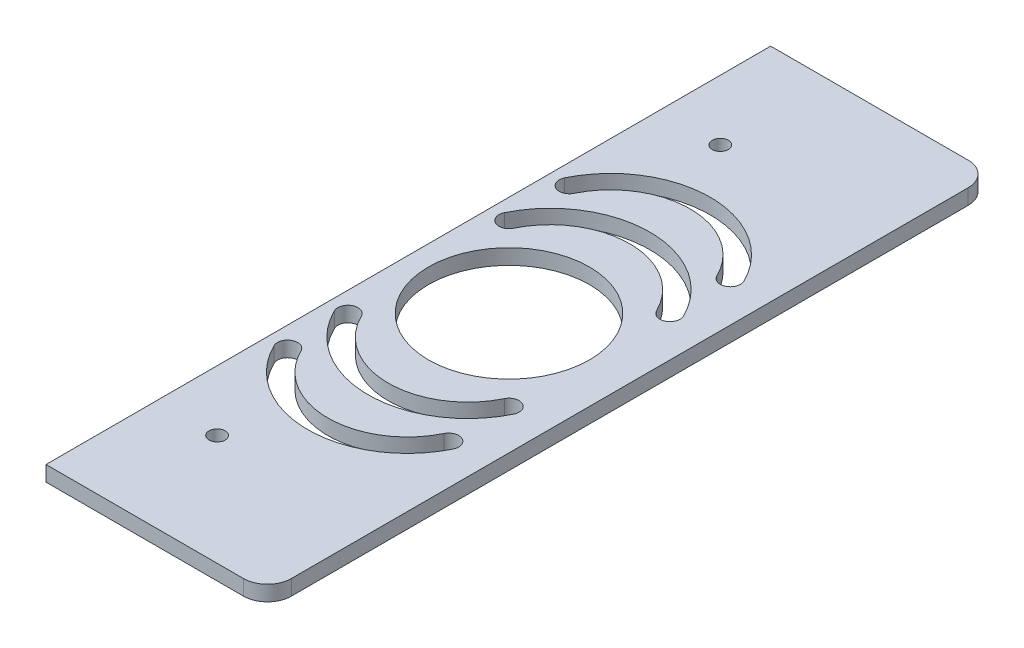
ISO-10303-21;
HEADER;
FILE_DESCRIPTION(('STEP AP214'),'2;1');
FILE_NAME('part.step','',(''),(''),'','','');
FILE_SCHEMA(('AUTOMOTIVE_DESIGN { 1 0 10303 214 1 1 1 1 }'));
ENDSEC;
DATA;
#1=APPLICATION_CONTEXT('core data for automotive mechanical design processes');
#2=APPLICATION_PROTOCOL_DEFINITION('international standard','automotive_design',2000,#1);
#3=PRODUCT_CONTEXT('',#1,'mechanical');
#4=PRODUCT('Part','Part','',(#3));
#5=PRODUCT_RELATED_PRODUCT_CATEGORY('part','',(#4));
#6=PRODUCT_DEFINITION_FORMATION('','',#4);
#7=PRODUCT_DEFINITION_CONTEXT('part definition',#1,'design');
#8=PRODUCT_DEFINITION('design','',#6,#7);
#9=PRODUCT_DEFINITION_SHAPE('','',#8);
#10=(LENGTH_UNIT() NAMED_UNIT(*) SI_UNIT(.MILLI.,.METRE.));
#11=(NAMED_UNIT(*) PLANE_ANGLE_UNIT() SI_UNIT($,.RADIAN.));
#12=(NAMED_UNIT(*) SI_UNIT($,.STERADIAN.) SOLID_ANGLE_UNIT());
#13=UNCERTAINTY_MEASURE_WITH_UNIT(LENGTH_MEASURE(1.E-05),#10,'distance_accuracy_value','');
#14=(GEOMETRIC_REPRESENTATION_CONTEXT(3) GLOBAL_UNCERTAINTY_ASSIGNED_CONTEXT((#13)) GLOBAL_UNIT_ASSIGNED_CONTEXT((#10,
#11,#12)) REPRESENTATION_CONTEXT('',''));
#15=CARTESIAN_POINT('',(0.,0.,0.));
#16=DIRECTION('',(0.,0.,1.));
#17=DIRECTION('',(1.,0.,0.));
#18=AXIS2_PLACEMENT_3D('',#15,#16,#17);
#19=CARTESIAN_POINT('',(0.,9.652,0.));
#20=DIRECTION('',(0.,-1.,0.));
#21=DIRECTION('',(0.,0.,-1.));
#22=AXIS2_PLACEMENT_3D('',#19,#20,#21);
#23=PLANE('',#22);
#24=CARTESIAN_POINT('',(12.7000000000004,9.65199999999999,-317.5));
#25=DIRECTION('',(0.,-1.,0.));
#26=DIRECTION('',(0.,0.,-1.));
#27=AXIS2_PLACEMENT_3D('',#24,#25,#26);
#28=CIRCLE('',#27,6.35000000000023);
#29=CARTESIAN_POINT('',(6.99213483146088,9.65199999999999,-320.282584269663));
#30=VERTEX_POINT('',#29);
#31=CARTESIAN_POINT('',(18.4078651685401,9.65199999999999,-314.717415730337));
#32=VERTEX_POINT('',#31);
#33=EDGE_CURVE('E222',#30,#32,#28,.F.);
#34=ORIENTED_EDGE('',*,*,#33,.F.);
#35=CARTESIAN_POINT('',(63.5000000000004,9.65199999999999,-292.735000000001));
#36=DIRECTION('',(0.,-1.,0.));
#37=DIRECTION('',(0.,0.,-1.));
#38=AXIS2_PLACEMENT_3D('',#35,#36,#37);
#39=CIRCLE('',#38,62.8649999999998);
#40=CARTESIAN_POINT('',(120.00786516854,9.65199999999999,-320.282584269663));
#41=VERTEX_POINT('',#40);
#42=EDGE_CURVE('E225',#41,#30,#39,.F.);
#43=ORIENTED_EDGE('',*,*,#42,.F.);
#44=CARTESIAN_POINT('',(114.3,9.65199999999999,-317.5));
#45=DIRECTION('',(0.,-1.,0.));
#46=DIRECTION('',(0.,0.,-1.));
#47=AXIS2_PLACEMENT_3D('',#44,#45,#46);
#48=CIRCLE('',#47,6.35000000000023);
#49=CARTESIAN_POINT('',(108.592134831461,9.65199999999999,-314.717415730337));
#50=VERTEX_POINT('',#49);
#51=EDGE_CURVE('E227',#50,#41,#48,.F.);
#52=ORIENTED_EDGE('',*,*,#51,.F.);
#53=CARTESIAN_POINT('',(63.5000000000004,9.65199999999999,-292.735000000001));
#54=DIRECTION('',(0.,-1.,0.));
#55=DIRECTION('',(0.,0.,-1.));
#56=AXIS2_PLACEMENT_3D('',#53,#54,#55);
#57=CIRCLE('',#56,50.1649999999993);
#58=EDGE_CURVE('E220',#32,#50,#57,.T.);
#59=ORIENTED_EDGE('',*,*,#58,.F.);
#60=EDGE_LOOP('',(#34,#43,#52,#59));
#61=FACE_BOUND('',#60,.T.);
#62=CARTESIAN_POINT('',(63.5000000000004,9.65199999999999,-164.464999999999));
#63=DIRECTION('',(0.,-1.,0.));
#64=DIRECTION('',(0.,0.,-1.));
#65=AXIS2_PLACEMENT_3D('',#62,#63,#64);
#66=CIRCLE('',#65,62.8649999999998);
#67=CARTESIAN_POINT('',(6.99213483146102,9.65199999999999,-136.917415730337));
#68=VERTEX_POINT('',#67);
#69=CARTESIAN_POINT('',(120.00786516854,9.65199999999999,-136.917415730337));
#70=VERTEX_POINT('',#69);
#71=EDGE_CURVE('E250',#68,#70,#66,.F.);
#72=ORIENTED_EDGE('',*,*,#71,.F.);
#73=CARTESIAN_POINT('',(12.7000000000004,9.65199999999999,-139.7));
#74=DIRECTION('',(0.,-1.,0.));
#75=DIRECTION('',(0.,0.,-1.));
#76=AXIS2_PLACEMENT_3D('',#73,#74,#75);
#77=CIRCLE('',#76,6.35000000000023);
#78=CARTESIAN_POINT('',(18.4078651685401,9.65199999999999,-142.482584269663));
#79=VERTEX_POINT('',#78);
#80=EDGE_CURVE('E253',#79,#68,#77,.F.);
#81=ORIENTED_EDGE('',*,*,#80,.F.);
#82=CARTESIAN_POINT('',(63.5000000000004,9.65199999999999,-164.464999999999));
#83=DIRECTION('',(0.,-1.,0.));
#84=DIRECTION('',(0.,0.,-1.));
#85=AXIS2_PLACEMENT_3D('',#82,#83,#84);
#86=CIRCLE('',#85,50.1649999999993);
#87=CARTESIAN_POINT('',(108.592134831461,9.65199999999999,-142.482584269663));
#88=VERTEX_POINT('',#87);
#89=EDGE_CURVE('E231',#88,#79,#86,.T.);
#90=ORIENTED_EDGE('',*,*,#89,.F.);
#91=CARTESIAN_POINT('',(114.3,9.65199999999999,-139.7));
#92=DIRECTION('',(0.,-1.,0.));
#93=DIRECTION('',(0.,0.,-1.));
#94=AXIS2_PLACEMENT_3D('',#91,#92,#93);
#95=CIRCLE('',#94,6.35000000000023);
#96=EDGE_CURVE('E248',#70,#88,#95,.F.);
#97=ORIENTED_EDGE('',*,*,#96,.F.);
#98=EDGE_LOOP('',(#72,#81,#90,#97));
#99=FACE_BOUND('',#98,.T.);
#100=CARTESIAN_POINT('',(63.5,9.65199999999999,-202.564999999999));
#101=DIRECTION('',(0.,-1.,0.));
#102=DIRECTION('',(0.,0.,-1.));
#103=AXIS2_PLACEMENT_3D('',#100,#101,#102);
#104=CIRCLE('',#103,62.8649999999997);
#105=CARTESIAN_POINT('',(6.99213483146063,9.65199999999999,-175.017415730337));
#106=VERTEX_POINT('',#105);
#107=CARTESIAN_POINT('',(120.00786516854,9.65199999999999,-175.017415730337));
#108=VERTEX_POINT('',#107);
#109=EDGE_CURVE('E649',#106,#108,#104,.F.);
#110=ORIENTED_EDGE('',*,*,#109,.F.);
#111=CARTESIAN_POINT('',(12.7,9.65199999999999,-177.8));
#112=DIRECTION('',(0.,-1.,0.));
#113=DIRECTION('',(0.,0.,-1.));
#114=AXIS2_PLACEMENT_3D('',#111,#112,#113);
#115=CIRCLE('',#114,6.35000000000023);
#116=CARTESIAN_POINT('',(18.4078651685397,9.65199999999999,-180.582584269663));
#117=VERTEX_POINT('',#116);
#118=EDGE_CURVE('E219',#117,#106,#115,.F.);
#119=ORIENTED_EDGE('',*,*,#118,.F.);
#120=CARTESIAN_POINT('',(63.5,9.65199999999999,-202.564999999999));
#121=DIRECTION('',(0.,-1.,0.));
#122=DIRECTION('',(0.,0.,-1.));
#123=AXIS2_PLACEMENT_3D('',#120,#121,#122);
#124=CIRCLE('',#123,50.1649999999993);
#125=CARTESIAN_POINT('',(108.59213483146,9.65199999999999,-180.582584269663));
#126=VERTEX_POINT('',#125);
#127=EDGE_CURVE('E216',#126,#117,#124,.T.);
#128=ORIENTED_EDGE('',*,*,#127,.F.);
#129=CARTESIAN_POINT('',(114.3,9.65199999999999,-177.8));
#130=DIRECTION('',(0.,-1.,0.));
#131=DIRECTION('',(0.,0.,-1.));
#132=AXIS2_PLACEMENT_3D('',#129,#130,#131);
#133=CIRCLE('',#132,6.35000000000023);
#134=EDGE_CURVE('E189',#108,#126,#133,.F.);
#135=ORIENTED_EDGE('',*,*,#134,.F.);
#136=EDGE_LOOP('',(#110,#119,#128,#135));
#137=FACE_BOUND('',#136,.T.);
#138=CARTESIAN_POINT('',(63.5,9.65199999999999,-254.635000000001));
#139=DIRECTION('',(0.,-1.,0.));
#140=DIRECTION('',(0.,0.,-1.));
#141=AXIS2_PLACEMENT_3D('',#138,#139,#140);
#142=CIRCLE('',#141,50.1649999999993);
#143=CARTESIAN_POINT('',(18.4078651685397,9.65199999999999,-276.617415730337));
#144=VERTEX_POINT('',#143);
#145=CARTESIAN_POINT('',(108.59213483146,9.65199999999999,-276.617415730337));
#146=VERTEX_POINT('',#145);
#147=EDGE_CURVE('E275',#144,#146,#142,.T.);
#148=ORIENTED_EDGE('',*,*,#147,.F.);
#149=CARTESIAN_POINT('',(12.7,9.65199999999999,-279.4));
#150=DIRECTION('',(0.,-1.,0.));
#151=DIRECTION('',(0.,0.,-1.));
#152=AXIS2_PLACEMENT_3D('',#149,#150,#151);
#153=CIRCLE('',#152,6.35000000000023);
#154=CARTESIAN_POINT('',(6.99213483146063,9.65199999999999,-282.182584269663));
#155=VERTEX_POINT('',#154);
#156=EDGE_CURVE('E278',#155,#144,#153,.F.);
#157=ORIENTED_EDGE('',*,*,#156,.F.);
#158=CARTESIAN_POINT('',(63.5,9.65199999999999,-254.635000000001));
#159=DIRECTION('',(0.,-1.,0.));
#160=DIRECTION('',(0.,0.,-1.));
#161=AXIS2_PLACEMENT_3D('',#158,#159,#160);
#162=CIRCLE('',#161,62.8649999999997);
#163=CARTESIAN_POINT('',(120.007865168539,9.65199999999999,-282.182584269663));
#164=VERTEX_POINT('',#163);
#165=EDGE_CURVE('E280',#164,#155,#162,.F.);
#166=ORIENTED_EDGE('',*,*,#165,.F.);
#167=CARTESIAN_POINT('',(114.3,9.65199999999999,-279.4));
#168=DIRECTION('',(0.,-1.,0.));
#169=DIRECTION('',(0.,0.,-1.));
#170=AXIS2_PLACEMENT_3D('',#167,#168,#169);
#171=CIRCLE('',#170,6.35000000000023);
#172=EDGE_CURVE('E272',#146,#164,#171,.F.);
#173=ORIENTED_EDGE('',*,*,#172,.F.);
#174=EDGE_LOOP('',(#148,#157,#166,#173));
#175=FACE_BOUND('',#174,.T.);
#176=DIRECTION('',(1.,0.,0.));
#177=VECTOR('',#176,1.);
#178=CARTESIAN_POINT('',(139.7,9.652,0.));
#179=LINE('',#178,#177);
#180=CARTESIAN_POINT('',(0.,9.652,0.));
#181=VERTEX_POINT('',#180);
#182=CARTESIAN_POINT('',(124.62,9.652,0.));
#183=VERTEX_POINT('',#182);
#184=EDGE_CURVE('E319',#181,#183,#179,.T.);
#185=ORIENTED_EDGE('',*,*,#184,.T.);
#186=CARTESIAN_POINT('',(124.62,9.652,-15.08));
#187=DIRECTION('',(0.,-1.,0.));
#188=DIRECTION('',(0.,0.,-1.));
#189=AXIS2_PLACEMENT_3D('',#186,#187,#188);
#190=CIRCLE('',#189,15.08);
#191=CARTESIAN_POINT('',(139.7,9.652,-15.08));
#192=VERTEX_POINT('',#191);
#193=EDGE_CURVE('E40',#183,#192,#190,.F.);
#194=ORIENTED_EDGE('',*,*,#193,.T.);
#195=DIRECTION('',(0.,0.,-1.));
#196=VECTOR('',#195,1.);
#197=CARTESIAN_POINT('',(139.7,9.652,-457.2));
#198=LINE('',#197,#196);
#199=CARTESIAN_POINT('',(139.7,9.652,-442.12));
#200=VERTEX_POINT('',#199);
#201=EDGE_CURVE('E322',#192,#200,#198,.T.);
#202=ORIENTED_EDGE('',*,*,#201,.T.);
#203=CARTESIAN_POINT('',(124.62,9.652,-442.12));
#204=DIRECTION('',(0.,-1.,0.));
#205=DIRECTION('',(0.,0.,-1.));
#206=AXIS2_PLACEMENT_3D('',#203,#204,#205);
#207=CIRCLE('',#206,15.08);
#208=CARTESIAN_POINT('',(124.62,9.652,-457.2));
#209=VERTEX_POINT('',#208);
#210=EDGE_CURVE('E355',#200,#209,#207,.F.);
#211=ORIENTED_EDGE('',*,*,#210,.T.);
#212=DIRECTION('',(-1.,0.,0.));
#213=VECTOR('',#212,1.);
#214=CARTESIAN_POINT('',(0.,9.652,-457.2));
#215=LINE('',#214,#213);
#216=CARTESIAN_POINT('',(0.,9.652,-457.2));
#217=VERTEX_POINT('',#216);
#218=EDGE_CURVE('E326',#209,#217,#215,.T.);
#219=ORIENTED_EDGE('',*,*,#218,.T.);
#220=DIRECTION('',(0.,0.,1.));
#221=VECTOR('',#220,1.);
#222=CARTESIAN_POINT('',(0.,9.652,0.));
#223=LINE('',#222,#221);
#224=EDGE_CURVE('E328',#217,#181,#223,.T.);
#225=ORIENTED_EDGE('',*,*,#224,.T.);
#226=EDGE_LOOP('',(#185,#194,#202,#211,#219,#225));
#227=FACE_BOUND('',#226,.T.);
#228=CARTESIAN_POINT('',(63.5,9.652,-228.6));
#229=DIRECTION('',(0.,1.,0.));
#230=DIRECTION('',(0.,0.,1.));
#231=AXIS2_PLACEMENT_3D('',#228,#229,#230);
#232=CIRCLE('',#231,50.8);
#233=CARTESIAN_POINT('',(63.5,9.652,-177.8));
#234=VERTEX_POINT('',#233);
#235=EDGE_CURVE('E313',#234,#234,#232,.T.);
#236=ORIENTED_EDGE('',*,*,#235,.F.);
#237=EDGE_LOOP('',(#236));
#238=FACE_BOUND('',#237,.T.);
#239=CARTESIAN_POINT('',(38.1,9.652,-69.85));
#240=DIRECTION('',(0.,1.,0.));
#241=DIRECTION('',(0.,0.,1.));
#242=AXIS2_PLACEMENT_3D('',#239,#240,#241);
#243=CIRCLE('',#242,5.08000000000001);
#244=CARTESIAN_POINT('',(38.1,9.652,-64.77));
#245=VERTEX_POINT('',#244);
#246=EDGE_CURVE('E307',#245,#245,#243,.T.);
#247=ORIENTED_EDGE('',*,*,#246,.F.);
#248=EDGE_LOOP('',(#247));
#249=FACE_BOUND('',#248,.T.);
#250=CARTESIAN_POINT('',(38.1,9.652,-387.35));
#251=DIRECTION('',(0.,1.,0.));
#252=DIRECTION('',(0.,0.,1.));
#253=AXIS2_PLACEMENT_3D('',#250,#251,#252);
#254=CIRCLE('',#253,5.08);
#255=CARTESIAN_POINT('',(38.1,9.652,-382.27));
#256=VERTEX_POINT('',#255);
#257=EDGE_CURVE('E301',#256,#256,#254,.T.);
#258=ORIENTED_EDGE('',*,*,#257,.F.);
#259=EDGE_LOOP('',(#258));
#260=FACE_BOUND('',#259,.T.);
#261=ADVANCED_FACE('F32',(#61,#99,#137,#175,#227,#238,#249,#260),#23,.F.);
#262=CARTESIAN_POINT('',(0.,0.,0.));
#263=DIRECTION('',(0.,-1.,0.));
#264=DIRECTION('',(0.,0.,-1.));
#265=AXIS2_PLACEMENT_3D('',#262,#263,#264);
#266=PLANE('',#265);
#267=CARTESIAN_POINT('',(63.5000000000004,0.,-292.735000000001));
#268=DIRECTION('',(0.,-1.,0.));
#269=DIRECTION('',(0.,0.,-1.));
#270=AXIS2_PLACEMENT_3D('',#267,#268,#269);
#271=CIRCLE('',#270,62.8649999999998);
#272=CARTESIAN_POINT('',(6.99213483146088,0.,-320.282584269663));
#273=VERTEX_POINT('',#272);
#274=CARTESIAN_POINT('',(120.00786516854,0.,-320.282584269663));
#275=VERTEX_POINT('',#274);
#276=EDGE_CURVE('E228',#273,#275,#271,.T.);
#277=ORIENTED_EDGE('',*,*,#276,.F.);
#278=CARTESIAN_POINT('',(12.7000000000004,0.,-317.5));
#279=DIRECTION('',(0.,-1.,0.));
#280=DIRECTION('',(0.,0.,-1.));
#281=AXIS2_PLACEMENT_3D('',#278,#279,#280);
#282=CIRCLE('',#281,6.35000000000023);
#283=CARTESIAN_POINT('',(18.40786516854,0.,-314.717415730337));
#284=VERTEX_POINT('',#283);
#285=EDGE_CURVE('E236',#284,#273,#282,.T.);
#286=ORIENTED_EDGE('',*,*,#285,.F.);
#287=CARTESIAN_POINT('',(63.5000000000004,0.,-292.735000000001));
#288=DIRECTION('',(0.,1.,0.));
#289=DIRECTION('',(0.,0.,-1.));
#290=AXIS2_PLACEMENT_3D('',#287,#288,#289);
#291=CIRCLE('',#290,50.1649999999993);
#292=CARTESIAN_POINT('',(108.592134831461,0.,-314.717415730337));
#293=VERTEX_POINT('',#292);
#294=EDGE_CURVE('E233',#293,#284,#291,.T.);
#295=ORIENTED_EDGE('',*,*,#294,.F.);
#296=CARTESIAN_POINT('',(114.3,0.,-317.5));
#297=DIRECTION('',(0.,-1.,0.));
#298=DIRECTION('',(0.,0.,-1.));
#299=AXIS2_PLACEMENT_3D('',#296,#297,#298);
#300=CIRCLE('',#299,6.35000000000023);
#301=EDGE_CURVE('E230',#275,#293,#300,.T.);
#302=ORIENTED_EDGE('',*,*,#301,.F.);
#303=EDGE_LOOP('',(#277,#286,#295,#302));
#304=FACE_BOUND('',#303,.T.);
#305=CARTESIAN_POINT('',(12.7000000000004,0.,-139.7));
#306=DIRECTION('',(0.,-1.,0.));
#307=DIRECTION('',(0.,0.,1.));
#308=AXIS2_PLACEMENT_3D('',#305,#306,#307);
#309=CIRCLE('',#308,6.35000000000023);
#310=CARTESIAN_POINT('',(6.99213483146102,0.,-136.917415730337));
#311=VERTEX_POINT('',#310);
#312=CARTESIAN_POINT('',(18.4078651685401,0.,-142.482584269663));
#313=VERTEX_POINT('',#312);
#314=EDGE_CURVE('E218',#311,#313,#309,.T.);
#315=ORIENTED_EDGE('',*,*,#314,.F.);
#316=CARTESIAN_POINT('',(63.5000000000004,0.,-164.464999999999));
#317=DIRECTION('',(0.,-1.,0.));
#318=DIRECTION('',(0.,0.,1.));
#319=AXIS2_PLACEMENT_3D('',#316,#317,#318);
#320=CIRCLE('',#319,62.8649999999998);
#321=CARTESIAN_POINT('',(120.00786516854,0.,-136.917415730337));
#322=VERTEX_POINT('',#321);
#323=EDGE_CURVE('E261',#322,#311,#320,.T.);
#324=ORIENTED_EDGE('',*,*,#323,.F.);
#325=CARTESIAN_POINT('',(114.3,0.,-139.7));
#326=DIRECTION('',(0.,-1.,0.));
#327=DIRECTION('',(0.,0.,1.));
#328=AXIS2_PLACEMENT_3D('',#325,#326,#327);
#329=CIRCLE('',#328,6.35000000000023);
#330=CARTESIAN_POINT('',(108.592134831461,0.,-142.482584269663));
#331=VERTEX_POINT('',#330);
#332=EDGE_CURVE('E258',#331,#322,#329,.T.);
#333=ORIENTED_EDGE('',*,*,#332,.F.);
#334=CARTESIAN_POINT('',(63.5000000000004,0.,-164.464999999999));
#335=DIRECTION('',(0.,1.,0.));
#336=DIRECTION('',(0.,0.,1.));
#337=AXIS2_PLACEMENT_3D('',#334,#335,#336);
#338=CIRCLE('',#337,50.1649999999993);
#339=EDGE_CURVE('E256',#313,#331,#338,.T.);
#340=ORIENTED_EDGE('',*,*,#339,.F.);
#341=EDGE_LOOP('',(#315,#324,#333,#340));
#342=FACE_BOUND('',#341,.T.);
#343=CARTESIAN_POINT('',(12.7,0.,-177.8));
#344=DIRECTION('',(0.,-1.,0.));
#345=DIRECTION('',(0.,0.,1.));
#346=AXIS2_PLACEMENT_3D('',#343,#344,#345);
#347=CIRCLE('',#346,6.35000000000023);
#348=CARTESIAN_POINT('',(6.99213483146063,0.,-175.017415730337));
#349=VERTEX_POINT('',#348);
#350=CARTESIAN_POINT('',(18.4078651685397,0.,-180.582584269663));
#351=VERTEX_POINT('',#350);
#352=EDGE_CURVE('E202',#349,#351,#347,.T.);
#353=ORIENTED_EDGE('',*,*,#352,.F.);
#354=CARTESIAN_POINT('',(63.5,0.,-202.564999999999));
#355=DIRECTION('',(0.,-1.,0.));
#356=DIRECTION('',(0.,0.,1.));
#357=AXIS2_PLACEMENT_3D('',#354,#355,#356);
#358=CIRCLE('',#357,62.8649999999997);
#359=CARTESIAN_POINT('',(120.007865168539,0.,-175.017415730337));
#360=VERTEX_POINT('',#359);
#361=EDGE_CURVE('E207',#360,#349,#358,.T.);
#362=ORIENTED_EDGE('',*,*,#361,.F.);
#363=CARTESIAN_POINT('',(114.3,0.,-177.8));
#364=DIRECTION('',(0.,-1.,0.));
#365=DIRECTION('',(0.,0.,1.));
#366=AXIS2_PLACEMENT_3D('',#363,#364,#365);
#367=CIRCLE('',#366,6.35000000000023);
#368=CARTESIAN_POINT('',(108.59213483146,0.,-180.582584269663));
#369=VERTEX_POINT('',#368);
#370=EDGE_CURVE('E186',#369,#360,#367,.T.);
#371=ORIENTED_EDGE('',*,*,#370,.F.);
#372=CARTESIAN_POINT('',(63.5,0.,-202.564999999999));
#373=DIRECTION('',(0.,1.,0.));
#374=DIRECTION('',(0.,0.,1.));
#375=AXIS2_PLACEMENT_3D('',#372,#373,#374);
#376=CIRCLE('',#375,50.1649999999993);
#377=EDGE_CURVE('E197',#351,#369,#376,.T.);
#378=ORIENTED_EDGE('',*,*,#377,.F.);
#379=EDGE_LOOP('',(#353,#362,#371,#378));
#380=FACE_BOUND('',#379,.T.);
#381=CARTESIAN_POINT('',(12.7,0.,-279.4));
#382=DIRECTION('',(0.,-1.,0.));
#383=DIRECTION('',(0.,0.,-1.));
#384=AXIS2_PLACEMENT_3D('',#381,#382,#383);
#385=CIRCLE('',#384,6.35000000000023);
#386=CARTESIAN_POINT('',(18.4078651685397,0.,-276.617415730337));
#387=VERTEX_POINT('',#386);
#388=CARTESIAN_POINT('',(6.99213483146063,0.,-282.182584269663));
#389=VERTEX_POINT('',#388);
#390=EDGE_CURVE('E247',#387,#389,#385,.T.);
#391=ORIENTED_EDGE('',*,*,#390,.F.);
#392=CARTESIAN_POINT('',(63.5,0.,-254.635000000001));
#393=DIRECTION('',(0.,1.,0.));
#394=DIRECTION('',(0.,0.,-1.));
#395=AXIS2_PLACEMENT_3D('',#392,#393,#394);
#396=CIRCLE('',#395,50.1649999999993);
#397=CARTESIAN_POINT('',(108.59213483146,0.,-276.617415730337));
#398=VERTEX_POINT('',#397);
#399=EDGE_CURVE('E288',#398,#387,#396,.T.);
#400=ORIENTED_EDGE('',*,*,#399,.F.);
#401=CARTESIAN_POINT('',(114.3,0.,-279.4));
#402=DIRECTION('',(0.,-1.,0.));
#403=DIRECTION('',(0.,0.,-1.));
#404=AXIS2_PLACEMENT_3D('',#401,#402,#403);
#405=CIRCLE('',#404,6.35000000000023);
#406=CARTESIAN_POINT('',(120.007865168539,0.,-282.182584269663));
#407=VERTEX_POINT('',#406);
#408=EDGE_CURVE('E285',#407,#398,#405,.T.);
#409=ORIENTED_EDGE('',*,*,#408,.F.);
#410=CARTESIAN_POINT('',(63.5,0.,-254.635000000001));
#411=DIRECTION('',(0.,-1.,0.));
#412=DIRECTION('',(0.,0.,-1.));
#413=AXIS2_PLACEMENT_3D('',#410,#411,#412);
#414=CIRCLE('',#413,62.8649999999997);
#415=EDGE_CURVE('E282',#389,#407,#414,.T.);
#416=ORIENTED_EDGE('',*,*,#415,.F.);
#417=EDGE_LOOP('',(#391,#400,#409,#416));
#418=FACE_BOUND('',#417,.T.);
#419=CARTESIAN_POINT('',(38.1,0.,-69.85));
#420=DIRECTION('',(0.,1.,0.));
#421=DIRECTION('',(0.,0.,1.));
#422=AXIS2_PLACEMENT_3D('',#419,#420,#421);
#423=CIRCLE('',#422,5.08000000000001);
#424=CARTESIAN_POINT('',(38.1,0.,-64.77));
#425=VERTEX_POINT('',#424);
#426=EDGE_CURVE('E304',#425,#425,#423,.T.);
#427=ORIENTED_EDGE('',*,*,#426,.T.);
#428=EDGE_LOOP('',(#427));
#429=FACE_BOUND('',#428,.T.);
#430=DIRECTION('',(0.,0.,-1.));
#431=VECTOR('',#430,1.);
#432=CARTESIAN_POINT('',(139.7,0.,-457.2));
#433=LINE('',#432,#431);
#434=CARTESIAN_POINT('',(139.7,0.,-15.08));
#435=VERTEX_POINT('',#434);
#436=CARTESIAN_POINT('',(139.7,0.,-442.12));
#437=VERTEX_POINT('',#436);
#438=EDGE_CURVE('E333',#435,#437,#433,.T.);
#439=ORIENTED_EDGE('',*,*,#438,.F.);
#440=CARTESIAN_POINT('',(124.62,0.,-15.08));
#441=DIRECTION('',(0.,-1.,0.));
#442=DIRECTION('',(0.,0.,-1.));
#443=AXIS2_PLACEMENT_3D('',#440,#441,#442);
#444=CIRCLE('',#443,15.08);
#445=CARTESIAN_POINT('',(124.62,0.,0.));
#446=VERTEX_POINT('',#445);
#447=EDGE_CURVE('E351',#435,#446,#444,.T.);
#448=ORIENTED_EDGE('',*,*,#447,.T.);
#449=DIRECTION('',(1.,0.,0.));
#450=VECTOR('',#449,1.);
#451=CARTESIAN_POINT('',(139.7,0.,0.));
#452=LINE('',#451,#450);
#453=CARTESIAN_POINT('',(0.,0.,0.));
#454=VERTEX_POINT('',#453);
#455=EDGE_CURVE('E316',#454,#446,#452,.T.);
#456=ORIENTED_EDGE('',*,*,#455,.F.);
#457=DIRECTION('',(0.,0.,1.));
#458=VECTOR('',#457,1.);
#459=CARTESIAN_POINT('',(0.,0.,0.));
#460=LINE('',#459,#458);
#461=CARTESIAN_POINT('',(0.,0.,-457.2));
#462=VERTEX_POINT('',#461);
#463=EDGE_CURVE('E323',#462,#454,#460,.T.);
#464=ORIENTED_EDGE('',*,*,#463,.F.);
#465=DIRECTION('',(-1.,0.,0.));
#466=VECTOR('',#465,1.);
#467=CARTESIAN_POINT('',(0.,0.,-457.2));
#468=LINE('',#467,#466);
#469=CARTESIAN_POINT('',(124.62,0.,-457.2));
#470=VERTEX_POINT('',#469);
#471=EDGE_CURVE('E336',#470,#462,#468,.T.);
#472=ORIENTED_EDGE('',*,*,#471,.F.);
#473=CARTESIAN_POINT('',(124.62,0.,-442.12));
#474=DIRECTION('',(0.,-1.,0.));
#475=DIRECTION('',(0.,0.,-1.));
#476=AXIS2_PLACEMENT_3D('',#473,#474,#475);
#477=CIRCLE('',#476,15.08);
#478=EDGE_CURVE('E349',#470,#437,#477,.T.);
#479=ORIENTED_EDGE('',*,*,#478,.T.);
#480=EDGE_LOOP('',(#439,#448,#456,#464,#472,#479));
#481=FACE_BOUND('',#480,.T.);
#482=CARTESIAN_POINT('',(63.5,0.,-228.6));
#483=DIRECTION('',(0.,1.,0.));
#484=DIRECTION('',(0.,0.,1.));
#485=AXIS2_PLACEMENT_3D('',#482,#483,#484);
#486=CIRCLE('',#485,50.8);
#487=CARTESIAN_POINT('',(63.5,0.,-177.8));
#488=VERTEX_POINT('',#487);
#489=EDGE_CURVE('E310',#488,#488,#486,.T.);
#490=ORIENTED_EDGE('',*,*,#489,.T.);
#491=EDGE_LOOP('',(#490));
#492=FACE_BOUND('',#491,.T.);
#493=CARTESIAN_POINT('',(38.1,0.,-387.35));
#494=DIRECTION('',(0.,1.,0.));
#495=DIRECTION('',(0.,0.,1.));
#496=AXIS2_PLACEMENT_3D('',#493,#494,#495);
#497=CIRCLE('',#496,5.08);
#498=CARTESIAN_POINT('',(38.1,0.,-382.27));
#499=VERTEX_POINT('',#498);
#500=EDGE_CURVE('E300',#499,#499,#497,.T.);
#501=ORIENTED_EDGE('',*,*,#500,.T.);
#502=EDGE_LOOP('',(#501));
#503=FACE_BOUND('',#502,.T.);
#504=ADVANCED_FACE('F204',(#304,#342,#380,#418,#429,#481,#492,#503),#266,.T.);
#505=CARTESIAN_POINT('',(139.7,9.652,0.));
#506=DIRECTION('',(0.,0.,-1.));
#507=DIRECTION('',(-1.,0.,0.));
#508=AXIS2_PLACEMENT_3D('',#505,#506,#507);
#509=PLANE('',#508);
#510=ORIENTED_EDGE('',*,*,#455,.T.);
#511=DIRECTION('',(0.,-1.,0.));
#512=VECTOR('',#511,1.);
#513=CARTESIAN_POINT('',(124.62,9.652,0.));
#514=LINE('',#513,#512);
#515=EDGE_CURVE('E353',#446,#183,#514,.F.);
#516=ORIENTED_EDGE('',*,*,#515,.T.);
#517=ORIENTED_EDGE('',*,*,#184,.F.);
#518=DIRECTION('',(0.,-1.,0.));
#519=VECTOR('',#518,1.);
#520=CARTESIAN_POINT('',(0.,9.652,0.));
#521=LINE('',#520,#519);
#522=EDGE_CURVE('E330',#181,#454,#521,.T.);
#523=ORIENTED_EDGE('',*,*,#522,.T.);
#524=EDGE_LOOP('',(#510,#516,#517,#523));
#525=FACE_BOUND('',#524,.T.);
#526=ADVANCED_FACE('F375',(#525),#509,.F.);
#527=CARTESIAN_POINT('',(139.7,9.652,-457.2));
#528=DIRECTION('',(-1.,0.,0.));
#529=DIRECTION('',(0.,0.,1.));
#530=AXIS2_PLACEMENT_3D('',#527,#528,#529);
#531=PLANE('',#530);
#532=ORIENTED_EDGE('',*,*,#201,.F.);
#533=DIRECTION('',(0.,-1.,0.));
#534=VECTOR('',#533,1.);
#535=CARTESIAN_POINT('',(139.7,9.652,-15.08));
#536=LINE('',#535,#534);
#537=EDGE_CURVE('E346',#192,#435,#536,.T.);
#538=ORIENTED_EDGE('',*,*,#537,.T.);
#539=ORIENTED_EDGE('',*,*,#438,.T.);
#540=DIRECTION('',(0.,-1.,0.));
#541=VECTOR('',#540,1.);
#542=CARTESIAN_POINT('',(139.7,9.652,-442.12));
#543=LINE('',#542,#541);
#544=EDGE_CURVE('E344',#437,#200,#543,.F.);
#545=ORIENTED_EDGE('',*,*,#544,.T.);
#546=EDGE_LOOP('',(#532,#538,#539,#545));
#547=FACE_BOUND('',#546,.T.);
#548=ADVANCED_FACE('F366',(#547),#531,.F.);
#549=CARTESIAN_POINT('',(0.,9.652,-457.2));
#550=DIRECTION('',(0.,0.,1.));
#551=DIRECTION('',(1.,0.,0.));
#552=AXIS2_PLACEMENT_3D('',#549,#550,#551);
#553=PLANE('',#552);
#554=ORIENTED_EDGE('',*,*,#218,.F.);
#555=DIRECTION('',(0.,-1.,0.));
#556=VECTOR('',#555,1.);
#557=CARTESIAN_POINT('',(124.62,9.652,-457.2));
#558=LINE('',#557,#556);
#559=EDGE_CURVE('E11',#209,#470,#558,.T.);
#560=ORIENTED_EDGE('',*,*,#559,.T.);
#561=ORIENTED_EDGE('',*,*,#471,.T.);
#562=DIRECTION('',(0.,-1.,0.));
#563=VECTOR('',#562,1.);
#564=CARTESIAN_POINT('',(0.,9.652,-457.2));
#565=LINE('',#564,#563);
#566=EDGE_CURVE('E341',#217,#462,#565,.T.);
#567=ORIENTED_EDGE('',*,*,#566,.F.);
#568=EDGE_LOOP('',(#554,#560,#561,#567));
#569=FACE_BOUND('',#568,.T.);
#570=ADVANCED_FACE('F384',(#569),#553,.F.);
#571=CARTESIAN_POINT('',(0.,9.652,0.));
#572=DIRECTION('',(1.,0.,0.));
#573=DIRECTION('',(0.,0.,-1.));
#574=AXIS2_PLACEMENT_3D('',#571,#572,#573);
#575=PLANE('',#574);
#576=ORIENTED_EDGE('',*,*,#463,.T.);
#577=ORIENTED_EDGE('',*,*,#522,.F.);
#578=ORIENTED_EDGE('',*,*,#224,.F.);
#579=ORIENTED_EDGE('',*,*,#566,.T.);
#580=EDGE_LOOP('',(#576,#577,#578,#579));
#581=FACE_BOUND('',#580,.T.);
#582=ADVANCED_FACE('F379',(#581),#575,.F.);
#583=CARTESIAN_POINT('',(63.5,9.652,-228.6));
#584=DIRECTION('',(0.,-1.,0.));
#585=DIRECTION('',(0.,0.,-1.));
#586=AXIS2_PLACEMENT_3D('',#583,#584,#585);
#587=CYLINDRICAL_SURFACE('',#586,50.8);
#588=ORIENTED_EDGE('',*,*,#235,.T.);
#589=EDGE_LOOP('',(#588));
#590=FACE_BOUND('',#589,.T.);
#591=ORIENTED_EDGE('',*,*,#489,.F.);
#592=EDGE_LOOP('',(#591));
#593=FACE_BOUND('',#592,.T.);
#594=ADVANCED_FACE('F408',(#590,#593),#587,.F.);
#595=CARTESIAN_POINT('',(38.1,9.652,-69.85));
#596=DIRECTION('',(0.,-1.,0.));
#597=DIRECTION('',(0.,0.,-1.));
#598=AXIS2_PLACEMENT_3D('',#595,#596,#597);
#599=CYLINDRICAL_SURFACE('',#598,5.08000000000001);
#600=ORIENTED_EDGE('',*,*,#246,.T.);
#601=EDGE_LOOP('',(#600));
#602=FACE_BOUND('',#601,.T.);
#603=ORIENTED_EDGE('',*,*,#426,.F.);
#604=EDGE_LOOP('',(#603));
#605=FACE_BOUND('',#604,.T.);
#606=ADVANCED_FACE('F442',(#602,#605),#599,.F.);
#607=CARTESIAN_POINT('',(38.1,9.652,-387.35));
#608=DIRECTION('',(0.,-1.,0.));
#609=DIRECTION('',(0.,0.,-1.));
#610=AXIS2_PLACEMENT_3D('',#607,#608,#609);
#611=CYLINDRICAL_SURFACE('',#610,5.08);
#612=ORIENTED_EDGE('',*,*,#257,.T.);
#613=EDGE_LOOP('',(#612));
#614=FACE_BOUND('',#613,.T.);
#615=ORIENTED_EDGE('',*,*,#500,.F.);
#616=EDGE_LOOP('',(#615));
#617=FACE_BOUND('',#616,.T.);
#618=ADVANCED_FACE('F396',(#614,#617),#611,.F.);
#619=CARTESIAN_POINT('',(124.62,9.652,-15.08));
#620=DIRECTION('',(0.,-1.,0.));
#621=DIRECTION('',(0.,0.,-1.));
#622=AXIS2_PLACEMENT_3D('',#619,#620,#621);
#623=CYLINDRICAL_SURFACE('',#622,15.08);
#624=ORIENTED_EDGE('',*,*,#193,.F.);
#625=ORIENTED_EDGE('',*,*,#515,.F.);
#626=ORIENTED_EDGE('',*,*,#447,.F.);
#627=ORIENTED_EDGE('',*,*,#537,.F.);
#628=EDGE_LOOP('',(#624,#625,#626,#627));
#629=FACE_BOUND('',#628,.T.);
#630=ADVANCED_FACE('F369',(#629),#623,.T.);
#631=CARTESIAN_POINT('',(124.62,9.652,-442.12));
#632=DIRECTION('',(0.,-1.,0.));
#633=DIRECTION('',(0.,0.,-1.));
#634=AXIS2_PLACEMENT_3D('',#631,#632,#633);
#635=CYLINDRICAL_SURFACE('',#634,15.08);
#636=ORIENTED_EDGE('',*,*,#210,.F.);
#637=ORIENTED_EDGE('',*,*,#544,.F.);
#638=ORIENTED_EDGE('',*,*,#478,.F.);
#639=ORIENTED_EDGE('',*,*,#559,.F.);
#640=EDGE_LOOP('',(#636,#637,#638,#639));
#641=FACE_BOUND('',#640,.T.);
#642=ADVANCED_FACE('F34',(#641),#635,.T.);
#643=CARTESIAN_POINT('',(12.7,132.290870265508,-279.4));
#644=DIRECTION('',(0.,-1.,0.));
#645=DIRECTION('',(0.,0.,-1.));
#646=AXIS2_PLACEMENT_3D('',#643,#644,#645);
#647=CYLINDRICAL_SURFACE('',#646,6.35000000000023);
#648=ORIENTED_EDGE('',*,*,#156,.T.);
#649=DIRECTION('',(0.,-1.,0.));
#650=VECTOR('',#649,1.);
#651=CARTESIAN_POINT('',(18.4078651685397,132.290870265508,-276.617415730337));
#652=LINE('',#651,#650);
#653=EDGE_CURVE('E276',#144,#387,#652,.T.);
#654=ORIENTED_EDGE('',*,*,#653,.T.);
#655=ORIENTED_EDGE('',*,*,#390,.T.);
#656=DIRECTION('',(0.,-1.,0.));
#657=VECTOR('',#656,1.);
#658=CARTESIAN_POINT('',(6.99213483146063,132.290870265508,-282.182584269663));
#659=LINE('',#658,#657);
#660=EDGE_CURVE('E291',#155,#389,#659,.T.);
#661=ORIENTED_EDGE('',*,*,#660,.F.);
#662=EDGE_LOOP('',(#648,#654,#655,#661));
#663=FACE_BOUND('',#662,.T.);
#664=ADVANCED_FACE('F388',(#663),#647,.F.);
#665=CARTESIAN_POINT('',(63.5,132.290870265508,-254.635000000001));
#666=DIRECTION('',(0.,-1.,0.));
#667=DIRECTION('',(0.,0.,-1.));
#668=AXIS2_PLACEMENT_3D('',#665,#666,#667);
#669=CYLINDRICAL_SURFACE('',#668,50.1649999999993);
#670=ORIENTED_EDGE('',*,*,#147,.T.);
#671=DIRECTION('',(0.,-1.,0.));
#672=VECTOR('',#671,1.);
#673=CARTESIAN_POINT('',(108.59213483146,132.290870265508,-276.617415730337));
#674=LINE('',#673,#672);
#675=EDGE_CURVE('E293',#146,#398,#674,.T.);
#676=ORIENTED_EDGE('',*,*,#675,.T.);
#677=ORIENTED_EDGE('',*,*,#399,.T.);
#678=ORIENTED_EDGE('',*,*,#653,.F.);
#679=EDGE_LOOP('',(#670,#676,#677,#678));
#680=FACE_BOUND('',#679,.T.);
#681=ADVANCED_FACE('F393',(#680),#669,.T.);
#682=CARTESIAN_POINT('',(114.3,132.290870265508,-279.4));
#683=DIRECTION('',(0.,-1.,0.));
#684=DIRECTION('',(0.,0.,-1.));
#685=AXIS2_PLACEMENT_3D('',#682,#683,#684);
#686=CYLINDRICAL_SURFACE('',#685,6.35000000000023);
#687=ORIENTED_EDGE('',*,*,#172,.T.);
#688=DIRECTION('',(0.,-1.,0.));
#689=VECTOR('',#688,1.);
#690=CARTESIAN_POINT('',(120.007865168539,132.290870265508,-282.182584269663));
#691=LINE('',#690,#689);
#692=EDGE_CURVE('E295',#164,#407,#691,.T.);
#693=ORIENTED_EDGE('',*,*,#692,.T.);
#694=ORIENTED_EDGE('',*,*,#408,.T.);
#695=ORIENTED_EDGE('',*,*,#675,.F.);
#696=EDGE_LOOP('',(#687,#693,#694,#695));
#697=FACE_BOUND('',#696,.T.);
#698=ADVANCED_FACE('F485',(#697),#686,.F.);
#699=CARTESIAN_POINT('',(63.5,132.290870265508,-254.635000000001));
#700=DIRECTION('',(0.,-1.,0.));
#701=DIRECTION('',(0.,0.,-1.));
#702=AXIS2_PLACEMENT_3D('',#699,#700,#701);
#703=CYLINDRICAL_SURFACE('',#702,62.8649999999997);
#704=ORIENTED_EDGE('',*,*,#165,.T.);
#705=ORIENTED_EDGE('',*,*,#660,.T.);
#706=ORIENTED_EDGE('',*,*,#415,.T.);
#707=ORIENTED_EDGE('',*,*,#692,.F.);
#708=EDGE_LOOP('',(#704,#705,#706,#707));
#709=FACE_BOUND('',#708,.T.);
#710=ADVANCED_FACE('F495',(#709),#703,.F.);
#711=CARTESIAN_POINT('',(12.7,132.290870265508,-177.8));
#712=DIRECTION('',(0.,-1.,0.));
#713=DIRECTION('',(0.,0.,-1.));
#714=AXIS2_PLACEMENT_3D('',#711,#712,#713);
#715=CYLINDRICAL_SURFACE('',#714,6.35000000000023);
#716=ORIENTED_EDGE('',*,*,#118,.T.);
#717=DIRECTION('',(0.,-1.,0.));
#718=VECTOR('',#717,1.);
#719=CARTESIAN_POINT('',(6.99213483146063,132.290870265508,-175.017415730337));
#720=LINE('',#719,#718);
#721=EDGE_CURVE('E212',#106,#349,#720,.T.);
#722=ORIENTED_EDGE('',*,*,#721,.T.);
#723=ORIENTED_EDGE('',*,*,#352,.T.);
#724=DIRECTION('',(0.,-1.,0.));
#725=VECTOR('',#724,1.);
#726=CARTESIAN_POINT('',(18.4078651685397,132.290870265508,-180.582584269663));
#727=LINE('',#726,#725);
#728=EDGE_CURVE('E193',#117,#351,#727,.T.);
#729=ORIENTED_EDGE('',*,*,#728,.F.);
#730=EDGE_LOOP('',(#716,#722,#723,#729));
#731=FACE_BOUND('',#730,.T.);
#732=ADVANCED_FACE('F505',(#731),#715,.F.);
#733=CARTESIAN_POINT('',(63.5,132.290870265508,-202.564999999999));
#734=DIRECTION('',(0.,-1.,0.));
#735=DIRECTION('',(0.,0.,-1.));
#736=AXIS2_PLACEMENT_3D('',#733,#734,#735);
#737=CYLINDRICAL_SURFACE('',#736,62.8649999999997);
#738=ORIENTED_EDGE('',*,*,#109,.T.);
#739=DIRECTION('',(0.,-1.,0.));
#740=VECTOR('',#739,1.);
#741=CARTESIAN_POINT('',(120.007865168539,132.290870265508,-175.017415730337));
#742=LINE('',#741,#740);
#743=EDGE_CURVE('E192',#108,#360,#742,.T.);
#744=ORIENTED_EDGE('',*,*,#743,.T.);
#745=ORIENTED_EDGE('',*,*,#361,.T.);
#746=ORIENTED_EDGE('',*,*,#721,.F.);
#747=EDGE_LOOP('',(#738,#744,#745,#746));
#748=FACE_BOUND('',#747,.T.);
#749=ADVANCED_FACE('F515',(#748),#737,.F.);
#750=CARTESIAN_POINT('',(114.3,132.290870265508,-177.8));
#751=DIRECTION('',(0.,-1.,0.));
#752=DIRECTION('',(0.,0.,-1.));
#753=AXIS2_PLACEMENT_3D('',#750,#751,#752);
#754=CYLINDRICAL_SURFACE('',#753,6.35000000000023);
#755=ORIENTED_EDGE('',*,*,#134,.T.);
#756=DIRECTION('',(0.,-1.,0.));
#757=VECTOR('',#756,1.);
#758=CARTESIAN_POINT('',(108.59213483146,132.290870265508,-180.582584269663));
#759=LINE('',#758,#757);
#760=EDGE_CURVE('E181',#126,#369,#759,.T.);
#761=ORIENTED_EDGE('',*,*,#760,.T.);
#762=ORIENTED_EDGE('',*,*,#370,.T.);
#763=ORIENTED_EDGE('',*,*,#743,.F.);
#764=EDGE_LOOP('',(#755,#761,#762,#763));
#765=FACE_BOUND('',#764,.T.);
#766=ADVANCED_FACE('F183',(#765),#754,.F.);
#767=CARTESIAN_POINT('',(63.5,132.290870265508,-202.564999999999));
#768=DIRECTION('',(0.,-1.,0.));
#769=DIRECTION('',(0.,0.,-1.));
#770=AXIS2_PLACEMENT_3D('',#767,#768,#769);
#771=CYLINDRICAL_SURFACE('',#770,50.1649999999993);
#772=ORIENTED_EDGE('',*,*,#127,.T.);
#773=ORIENTED_EDGE('',*,*,#728,.T.);
#774=ORIENTED_EDGE('',*,*,#377,.T.);
#775=ORIENTED_EDGE('',*,*,#760,.F.);
#776=EDGE_LOOP('',(#772,#773,#774,#775));
#777=FACE_BOUND('',#776,.T.);
#778=ADVANCED_FACE('F198',(#777),#771,.T.);
#779=CARTESIAN_POINT('',(12.7000000000004,132.290870265508,-139.7));
#780=DIRECTION('',(0.,-1.,0.));
#781=DIRECTION('',(0.,0.,-1.));
#782=AXIS2_PLACEMENT_3D('',#779,#780,#781);
#783=CYLINDRICAL_SURFACE('',#782,6.35000000000023);
#784=ORIENTED_EDGE('',*,*,#80,.T.);
#785=DIRECTION('',(0.,-1.,0.));
#786=VECTOR('',#785,1.);
#787=CARTESIAN_POINT('',(6.99213483146102,132.290870265508,-136.917415730337));
#788=LINE('',#787,#786);
#789=EDGE_CURVE('E251',#68,#311,#788,.T.);
#790=ORIENTED_EDGE('',*,*,#789,.T.);
#791=ORIENTED_EDGE('',*,*,#314,.T.);
#792=DIRECTION('',(0.,-1.,0.));
#793=VECTOR('',#792,1.);
#794=CARTESIAN_POINT('',(18.4078651685401,132.290870265508,-142.482584269663));
#795=LINE('',#794,#793);
#796=EDGE_CURVE('E264',#79,#313,#795,.T.);
#797=ORIENTED_EDGE('',*,*,#796,.F.);
#798=EDGE_LOOP('',(#784,#790,#791,#797));
#799=FACE_BOUND('',#798,.T.);
#800=ADVANCED_FACE('F542',(#799),#783,.F.);
#801=CARTESIAN_POINT('',(63.5000000000004,132.290870265508,-164.464999999999));
#802=DIRECTION('',(0.,-1.,0.));
#803=DIRECTION('',(0.,0.,-1.));
#804=AXIS2_PLACEMENT_3D('',#801,#802,#803);
#805=CYLINDRICAL_SURFACE('',#804,62.8649999999998);
#806=ORIENTED_EDGE('',*,*,#71,.T.);
#807=DIRECTION('',(0.,-1.,0.));
#808=VECTOR('',#807,1.);
#809=CARTESIAN_POINT('',(120.00786516854,132.290870265508,-136.917415730337));
#810=LINE('',#809,#808);
#811=EDGE_CURVE('E266',#70,#322,#810,.T.);
#812=ORIENTED_EDGE('',*,*,#811,.T.);
#813=ORIENTED_EDGE('',*,*,#323,.T.);
#814=ORIENTED_EDGE('',*,*,#789,.F.);
#815=EDGE_LOOP('',(#806,#812,#813,#814));
#816=FACE_BOUND('',#815,.T.);
#817=ADVANCED_FACE('F551',(#816),#805,.F.);
#818=CARTESIAN_POINT('',(114.3,132.290870265508,-139.7));
#819=DIRECTION('',(0.,-1.,0.));
#820=DIRECTION('',(0.,0.,-1.));
#821=AXIS2_PLACEMENT_3D('',#818,#819,#820);
#822=CYLINDRICAL_SURFACE('',#821,6.35000000000023);
#823=ORIENTED_EDGE('',*,*,#96,.T.);
#824=DIRECTION('',(0.,-1.,0.));
#825=VECTOR('',#824,1.);
#826=CARTESIAN_POINT('',(108.592134831461,132.290870265508,-142.482584269663));
#827=LINE('',#826,#825);
#828=EDGE_CURVE('E55',#88,#331,#827,.T.);
#829=ORIENTED_EDGE('',*,*,#828,.T.);
#830=ORIENTED_EDGE('',*,*,#332,.T.);
#831=ORIENTED_EDGE('',*,*,#811,.F.);
#832=EDGE_LOOP('',(#823,#829,#830,#831));
#833=FACE_BOUND('',#832,.T.);
#834=ADVANCED_FACE('F561',(#833),#822,.F.);
#835=CARTESIAN_POINT('',(63.5000000000004,132.290870265508,-164.464999999999));
#836=DIRECTION('',(0.,-1.,0.));
#837=DIRECTION('',(0.,0.,-1.));
#838=AXIS2_PLACEMENT_3D('',#835,#836,#837);
#839=CYLINDRICAL_SURFACE('',#838,50.1649999999993);
#840=ORIENTED_EDGE('',*,*,#89,.T.);
#841=ORIENTED_EDGE('',*,*,#796,.T.);
#842=ORIENTED_EDGE('',*,*,#339,.T.);
#843=ORIENTED_EDGE('',*,*,#828,.F.);
#844=EDGE_LOOP('',(#840,#841,#842,#843));
#845=FACE_BOUND('',#844,.T.);
#846=ADVANCED_FACE('F571',(#845),#839,.T.);
#847=CARTESIAN_POINT('',(63.5000000000004,132.290870265508,-292.735000000001));
#848=DIRECTION('',(0.,-1.,0.));
#849=DIRECTION('',(0.,0.,-1.));
#850=AXIS2_PLACEMENT_3D('',#847,#848,#849);
#851=CYLINDRICAL_SURFACE('',#850,62.8649999999998);
#852=ORIENTED_EDGE('',*,*,#42,.T.);
#853=DIRECTION('',(0.,-1.,0.));
#854=VECTOR('',#853,1.);
#855=CARTESIAN_POINT('',(6.99213483146088,132.290870265508,-320.282584269663));
#856=LINE('',#855,#854);
#857=EDGE_CURVE('E223',#30,#273,#856,.T.);
#858=ORIENTED_EDGE('',*,*,#857,.T.);
#859=ORIENTED_EDGE('',*,*,#276,.T.);
#860=DIRECTION('',(0.,-1.,0.));
#861=VECTOR('',#860,1.);
#862=CARTESIAN_POINT('',(120.00786516854,132.290870265508,-320.282584269663));
#863=LINE('',#862,#861);
#864=EDGE_CURVE('E239',#41,#275,#863,.T.);
#865=ORIENTED_EDGE('',*,*,#864,.F.);
#866=EDGE_LOOP('',(#852,#858,#859,#865));
#867=FACE_BOUND('',#866,.T.);
#868=ADVANCED_FACE('F581',(#867),#851,.F.);
#869=CARTESIAN_POINT('',(12.7000000000004,132.290870265508,-317.5));
#870=DIRECTION('',(0.,-1.,0.));
#871=DIRECTION('',(0.,0.,-1.));
#872=AXIS2_PLACEMENT_3D('',#869,#870,#871);
#873=CYLINDRICAL_SURFACE('',#872,6.35000000000023);
#874=ORIENTED_EDGE('',*,*,#33,.T.);
#875=DIRECTION('',(0.,-1.,0.));
#876=VECTOR('',#875,1.);
#877=CARTESIAN_POINT('',(18.40786516854,132.290870265508,-314.717415730337));
#878=LINE('',#877,#876);
#879=EDGE_CURVE('E241',#32,#284,#878,.T.);
#880=ORIENTED_EDGE('',*,*,#879,.T.);
#881=ORIENTED_EDGE('',*,*,#285,.T.);
#882=ORIENTED_EDGE('',*,*,#857,.F.);
#883=EDGE_LOOP('',(#874,#880,#881,#882));
#884=FACE_BOUND('',#883,.T.);
#885=ADVANCED_FACE('F590',(#884),#873,.F.);
#886=CARTESIAN_POINT('',(63.5000000000004,132.290870265508,-292.735000000001));
#887=DIRECTION('',(0.,-1.,0.));
#888=DIRECTION('',(0.,0.,-1.));
#889=AXIS2_PLACEMENT_3D('',#886,#887,#888);
#890=CYLINDRICAL_SURFACE('',#889,50.1649999999993);
#891=ORIENTED_EDGE('',*,*,#58,.T.);
#892=DIRECTION('',(0.,-1.,0.));
#893=VECTOR('',#892,1.);
#894=CARTESIAN_POINT('',(108.592134831461,132.290870265508,-314.717415730337));
#895=LINE('',#894,#893);
#896=EDGE_CURVE('E47',#50,#293,#895,.T.);
#897=ORIENTED_EDGE('',*,*,#896,.T.);
#898=ORIENTED_EDGE('',*,*,#294,.T.);
#899=ORIENTED_EDGE('',*,*,#879,.F.);
#900=EDGE_LOOP('',(#891,#897,#898,#899));
#901=FACE_BOUND('',#900,.T.);
#902=ADVANCED_FACE('F600',(#901),#890,.T.);
#903=CARTESIAN_POINT('',(114.3,132.290870265508,-317.5));
#904=DIRECTION('',(0.,-1.,0.));
#905=DIRECTION('',(0.,0.,-1.));
#906=AXIS2_PLACEMENT_3D('',#903,#904,#905);
#907=CYLINDRICAL_SURFACE('',#906,6.35000000000023);
#908=ORIENTED_EDGE('',*,*,#51,.T.);
#909=ORIENTED_EDGE('',*,*,#864,.T.);
#910=ORIENTED_EDGE('',*,*,#301,.T.);
#911=ORIENTED_EDGE('',*,*,#896,.F.);
#912=EDGE_LOOP('',(#908,#909,#910,#911));
#913=FACE_BOUND('',#912,.T.);
#914=ADVANCED_FACE('F610',(#913),#907,.F.);
#915=CLOSED_SHELL('',(#261,#504,#526,#548,#570,#582,#594,#606,#618,#630,#642,#664,#681,#698,
#710,#732,#749,#766,#778,#800,#817,#834,#846,#868,#885,#902,#914));
#916=MANIFOLD_SOLID_BREP('B2',#915);
#917=ADVANCED_BREP_SHAPE_REPRESENTATION('',(#18,#916),#14);
#918=SHAPE_DEFINITION_REPRESENTATION(#9,#917);
ENDSEC;
END-ISO-10303-21;
